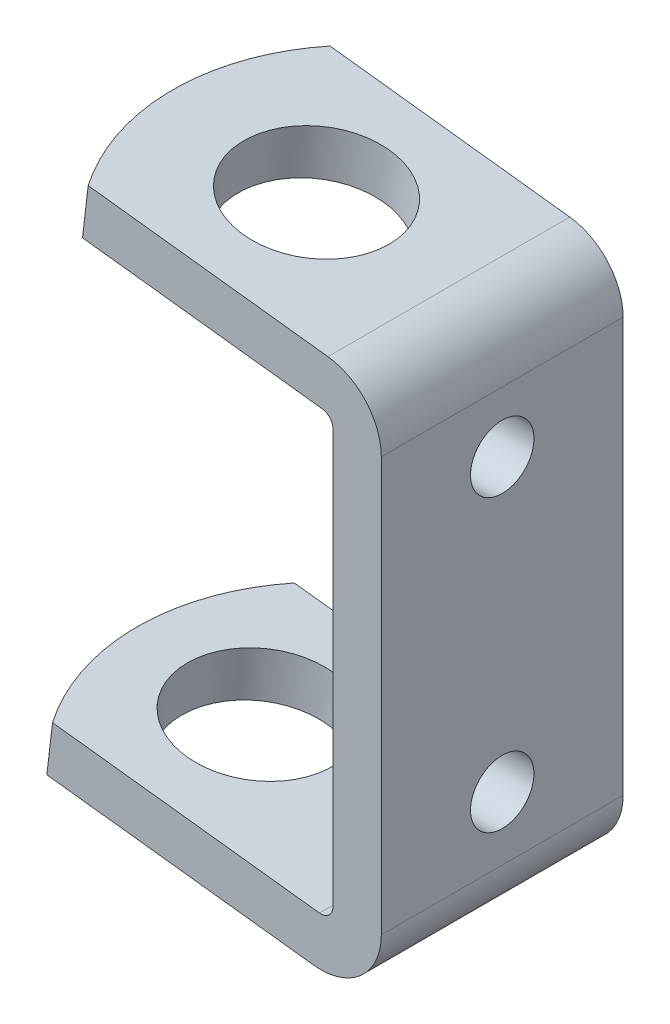
ISO-10303-21;
HEADER;
FILE_DESCRIPTION(('STEP AP214'),'2;1');
FILE_NAME('part.step','',(''),(''),'','','');
FILE_SCHEMA(('AUTOMOTIVE_DESIGN { 1 0 10303 214 1 1 1 1 }'));
ENDSEC;
DATA;
#1=APPLICATION_CONTEXT('core data for automotive mechanical design processes');
#2=APPLICATION_PROTOCOL_DEFINITION('international standard','automotive_design',2000,#1);
#3=PRODUCT_CONTEXT('',#1,'mechanical');
#4=PRODUCT('Part','Part','',(#3));
#5=PRODUCT_RELATED_PRODUCT_CATEGORY('part','',(#4));
#6=PRODUCT_DEFINITION_FORMATION('','',#4);
#7=PRODUCT_DEFINITION_CONTEXT('part definition',#1,'design');
#8=PRODUCT_DEFINITION('design','',#6,#7);
#9=PRODUCT_DEFINITION_SHAPE('','',#8);
#10=(LENGTH_UNIT() NAMED_UNIT(*) SI_UNIT(.MILLI.,.METRE.));
#11=(NAMED_UNIT(*) PLANE_ANGLE_UNIT() SI_UNIT($,.RADIAN.));
#12=(NAMED_UNIT(*) SI_UNIT($,.STERADIAN.) SOLID_ANGLE_UNIT());
#13=UNCERTAINTY_MEASURE_WITH_UNIT(LENGTH_MEASURE(1.E-05),#10,'distance_accuracy_value','');
#14=(GEOMETRIC_REPRESENTATION_CONTEXT(3) GLOBAL_UNCERTAINTY_ASSIGNED_CONTEXT((#13)) GLOBAL_UNIT_ASSIGNED_CONTEXT((#10,
#11,#12)) REPRESENTATION_CONTEXT('',''));
#15=CARTESIAN_POINT('',(0.,0.,0.));
#16=DIRECTION('',(0.,0.,1.));
#17=DIRECTION('',(1.,0.,0.));
#18=AXIS2_PLACEMENT_3D('',#15,#16,#17);
#19=CARTESIAN_POINT('',(16.1601957420386,2.8418070474657,0.));
#20=DIRECTION('',(0.1169596337903,0.993136669378208,0.));
#21=DIRECTION('',(-0.993136669378208,0.1169596337903,0.));
#22=AXIS2_PLACEMENT_3D('',#19,#20,#21);
#23=CYLINDRICAL_SURFACE('',#22,9.6012);
#24=CARTESIAN_POINT('',(16.1601957420386,2.84180704746571,0.));
#25=DIRECTION('',(0.1169596337903,0.993136669378208,0.));
#26=DIRECTION('',(-0.993136669378208,0.1169596337903,0.));
#27=AXIS2_PLACEMENT_3D('',#24,#25,#26);
#28=CIRCLE('',#27,9.6012);
#29=CARTESIAN_POINT('',(6.62489195200452,3.96475988341313,0.));
#30=VERTEX_POINT('',#29);
#31=EDGE_CURVE('E20',#30,#30,#28,.T.);
#32=ORIENTED_EDGE('',*,*,#31,.F.);
#33=EDGE_LOOP('',(#32));
#34=FACE_BOUND('',#33,.T.);
#35=CARTESIAN_POINT('',(16.902889416607,9.14822489801733,0.));
#36=DIRECTION('',(0.1169596337903,0.993136669378208,0.));
#37=DIRECTION('',(-0.993136669378208,0.1169596337903,0.));
#38=AXIS2_PLACEMENT_3D('',#35,#36,#37);
#39=CIRCLE('',#38,9.6012);
#40=CARTESIAN_POINT('',(7.36758562657293,10.2711777339648,0.));
#41=VERTEX_POINT('',#40);
#42=EDGE_CURVE('E183',#41,#41,#39,.F.);
#43=ORIENTED_EDGE('',*,*,#42,.F.);
#44=EDGE_LOOP('',(#43));
#45=FACE_BOUND('',#44,.T.);
#46=ADVANCED_FACE('F17',(#34,#45),#23,.F.);
#47=CARTESIAN_POINT('',(24.3075817343848,72.2230147334628,0.));
#48=DIRECTION('',(-0.116959633790301,-0.993136669378207,0.));
#49=DIRECTION('',(0.993136669378207,-0.116959633790301,0.));
#50=AXIS2_PLACEMENT_3D('',#47,#48,#49);
#51=CYLINDRICAL_SURFACE('',#50,9.6012);
#52=CARTESIAN_POINT('',(24.3075817343848,72.2230147334628,0.));
#53=DIRECTION('',(-0.116959633790301,-0.993136669378207,0.));
#54=DIRECTION('',(0.993136669378207,-0.116959633790301,0.));
#55=AXIS2_PLACEMENT_3D('',#52,#53,#54);
#56=CIRCLE('',#55,9.6012);
#57=CARTESIAN_POINT('',(33.8428855244188,71.1000618975154,0.));
#58=VERTEX_POINT('',#57);
#59=EDGE_CURVE('E172',#58,#58,#56,.T.);
#60=ORIENTED_EDGE('',*,*,#59,.F.);
#61=EDGE_LOOP('',(#60));
#62=FACE_BOUND('',#61,.T.);
#63=CARTESIAN_POINT('',(23.5648880598164,65.9165968829112,0.));
#64=DIRECTION('',(-0.116959633790301,-0.993136669378207,0.));
#65=DIRECTION('',(0.993136669378207,-0.116959633790301,0.));
#66=AXIS2_PLACEMENT_3D('',#63,#64,#65);
#67=CIRCLE('',#66,9.6012);
#68=CARTESIAN_POINT('',(33.1001918498504,64.7936440469638,0.));
#69=VERTEX_POINT('',#68);
#70=EDGE_CURVE('E114',#69,#69,#67,.F.);
#71=ORIENTED_EDGE('',*,*,#70,.F.);
#72=EDGE_LOOP('',(#71));
#73=FACE_BOUND('',#72,.T.);
#74=ADVANCED_FACE('F397',(#62,#73),#51,.F.);
#75=CARTESIAN_POINT('',(39.8281819351588,0.054477686810474,0.));
#76=DIRECTION('',(-0.1169596337903,-0.993136669378207,0.));
#77=DIRECTION('',(0.993136669378207,-0.1169596337903,0.));
#78=AXIS2_PLACEMENT_3D('',#75,#76,#77);
#79=PLANE('',#78);
#80=ORIENTED_EDGE('',*,*,#31,.T.);
#81=EDGE_LOOP('',(#80));
#82=FACE_BOUND('',#81,.T.);
#83=DIRECTION('',(0.,0.,1.));
#84=VECTOR('',#83,1.);
#85=CARTESIAN_POINT('',(39.8281819351588,0.0544776868104824,0.));
#86=LINE('',#85,#84);
#87=CARTESIAN_POINT('',(39.8281819351588,0.0544776868104755,15.875));
#88=VERTEX_POINT('',#87);
#89=CARTESIAN_POINT('',(39.8281819351588,0.0544776868104755,-15.875));
#90=VERTEX_POINT('',#89);
#91=EDGE_CURVE('E166',#88,#90,#86,.F.);
#92=ORIENTED_EDGE('',*,*,#91,.F.);
#93=DIRECTION('',(0.993136669378208,-0.1169596337903,0.));
#94=VECTOR('',#93,1.);
#95=CARTESIAN_POINT('',(4.78242539288279,4.18174332654856,15.875));
#96=LINE('',#95,#94);
#97=CARTESIAN_POINT('',(4.78242539288279,4.18174332654856,15.875));
#98=VERTEX_POINT('',#97);
#99=EDGE_CURVE('E130',#98,#88,#96,.T.);
#100=ORIENTED_EDGE('',*,*,#99,.F.);
#101=CARTESIAN_POINT('',(28.3788803274823,1.40283805298941,0.));
#102=DIRECTION('',(0.1169596337903,0.993136669378208,0.));
#103=DIRECTION('',(-0.993136669378208,0.1169596337903,0.));
#104=AXIS2_PLACEMENT_3D('',#101,#102,#103);
#105=CIRCLE('',#104,28.575);
#106=CARTESIAN_POINT('',(4.78242539288277,4.18174332654856,-15.875));
#107=VERTEX_POINT('',#106);
#108=EDGE_CURVE('E178',#107,#98,#105,.T.);
#109=ORIENTED_EDGE('',*,*,#108,.F.);
#110=DIRECTION('',(0.993136669378208,-0.1169596337903,0.));
#111=VECTOR('',#110,1.);
#112=CARTESIAN_POINT('',(4.78242539288276,4.18174332654856,-15.875));
#113=LINE('',#112,#111);
#114=EDGE_CURVE('E162',#107,#90,#113,.T.);
#115=ORIENTED_EDGE('',*,*,#114,.T.);
#116=EDGE_LOOP('',(#92,#100,#109,#115));
#117=FACE_BOUND('',#116,.T.);
#118=ADVANCED_FACE('F238',(#82,#117),#79,.T.);
#119=CARTESIAN_POINT('',(33.8018938083902,71.1048894064,0.));
#120=DIRECTION('',(-0.116959633790301,-0.993136669378207,0.));
#121=DIRECTION('',(0.993136669378207,-0.116959633790301,0.));
#122=AXIS2_PLACEMENT_3D('',#119,#120,#121);
#123=CYLINDRICAL_SURFACE('',#122,28.575);
#124=CARTESIAN_POINT('',(33.8018938083902,71.1048894064001,0.));
#125=DIRECTION('',(-0.116959633790301,-0.993136669378207,0.));
#126=DIRECTION('',(0.993136669378207,-0.116959633790301,0.));
#127=AXIS2_PLACEMENT_3D('',#124,#125,#126);
#128=CIRCLE('',#127,28.575);
#129=CARTESIAN_POINT('',(10.2054388737907,73.8837946799592,-15.875));
#130=VERTEX_POINT('',#129);
#131=CARTESIAN_POINT('',(10.2054388737907,73.8837946799592,15.875));
#132=VERTEX_POINT('',#131);
#133=EDGE_CURVE('E176',#130,#132,#128,.F.);
#134=ORIENTED_EDGE('',*,*,#133,.F.);
#135=DIRECTION('',(-0.1169596337903,-0.993136669378207,0.));
#136=VECTOR('',#135,1.);
#137=CARTESIAN_POINT('',(10.2054388737907,73.8837946799592,-15.875));
#138=LINE('',#137,#136);
#139=CARTESIAN_POINT('',(9.46274519922232,67.5773768294076,-15.875));
#140=VERTEX_POINT('',#139);
#141=EDGE_CURVE('E111',#130,#140,#138,.T.);
#142=ORIENTED_EDGE('',*,*,#141,.T.);
#143=CARTESIAN_POINT('',(33.0592001338218,64.7984715558484,0.));
#144=DIRECTION('',(-0.116959633790301,-0.993136669378207,0.));
#145=DIRECTION('',(0.993136669378207,-0.116959633790301,0.));
#146=AXIS2_PLACEMENT_3D('',#143,#144,#145);
#147=CIRCLE('',#146,28.575);
#148=CARTESIAN_POINT('',(9.46274519922232,67.5773768294076,15.875));
#149=VERTEX_POINT('',#148);
#150=EDGE_CURVE('E104',#149,#140,#147,.T.);
#151=ORIENTED_EDGE('',*,*,#150,.F.);
#152=DIRECTION('',(-0.1169596337903,-0.993136669378207,0.));
#153=VECTOR('',#152,1.);
#154=CARTESIAN_POINT('',(10.2054388737907,73.8837946799592,15.875));
#155=LINE('',#154,#153);
#156=EDGE_CURVE('E108',#132,#149,#155,.T.);
#157=ORIENTED_EDGE('',*,*,#156,.F.);
#158=EDGE_LOOP('',(#134,#142,#151,#157));
#159=FACE_BOUND('',#158,.T.);
#160=ADVANCED_FACE('F106',(#159),#123,.T.);
#161=CARTESIAN_POINT('',(40.9422224470114,63.8701044626379,0.));
#162=DIRECTION('',(-0.1169596337903,-0.993136669378207,0.));
#163=DIRECTION('',(0.993136669378207,-0.1169596337903,0.));
#164=AXIS2_PLACEMENT_3D('',#161,#162,#163);
#165=PLANE('',#164);
#166=ORIENTED_EDGE('',*,*,#70,.T.);
#167=EDGE_LOOP('',(#166));
#168=FACE_BOUND('',#167,.T.);
#169=DIRECTION('',(0.,0.,1.));
#170=VECTOR('',#169,1.);
#171=CARTESIAN_POINT('',(40.9422224470114,63.8701044626379,0.));
#172=LINE('',#171,#170);
#173=CARTESIAN_POINT('',(40.9422224470114,63.8701044626379,-15.875));
#174=VERTEX_POINT('',#173);
#175=CARTESIAN_POINT('',(40.9422224470114,63.8701044626379,15.875));
#176=VERTEX_POINT('',#175);
#177=EDGE_CURVE('E119',#174,#176,#172,.T.);
#178=ORIENTED_EDGE('',*,*,#177,.T.);
#179=DIRECTION('',(0.993136669378207,-0.1169596337903,0.));
#180=VECTOR('',#179,1.);
#181=CARTESIAN_POINT('',(9.46274519922232,67.5773768294076,15.875));
#182=LINE('',#181,#180);
#183=EDGE_CURVE('E116',#149,#176,#182,.T.);
#184=ORIENTED_EDGE('',*,*,#183,.F.);
#185=ORIENTED_EDGE('',*,*,#150,.T.);
#186=DIRECTION('',(0.993136669378207,-0.1169596337903,0.));
#187=VECTOR('',#186,1.);
#188=CARTESIAN_POINT('',(9.46274519922232,67.5773768294076,-15.875));
#189=LINE('',#188,#187);
#190=EDGE_CURVE('E158',#140,#174,#189,.T.);
#191=ORIENTED_EDGE('',*,*,#190,.T.);
#192=EDGE_LOOP('',(#178,#184,#185,#191));
#193=FACE_BOUND('',#192,.T.);
#194=ADVANCED_FACE('F117',(#168,#193),#165,.T.);
#195=CARTESIAN_POINT('',(40.7565490283693,62.2935,0.));
#196=DIRECTION('',(0.,0.,1.));
#197=DIRECTION('',(1.,0.,0.));
#198=AXIS2_PLACEMENT_3D('',#195,#196,#197);
#199=CYLINDRICAL_SURFACE('',#198,1.5875);
#200=ORIENTED_EDGE('',*,*,#177,.F.);
#201=CARTESIAN_POINT('',(40.7565490283693,62.2935,-15.875));
#202=DIRECTION('',(0.,0.,1.));
#203=DIRECTION('',(1.,0.,0.));
#204=AXIS2_PLACEMENT_3D('',#201,#202,#203);
#205=CIRCLE('',#204,1.5875);
#206=CARTESIAN_POINT('',(42.3440490283693,62.2935,-15.875));
#207=VERTEX_POINT('',#206);
#208=EDGE_CURVE('E156',#174,#207,#205,.F.);
#209=ORIENTED_EDGE('',*,*,#208,.T.);
#210=DIRECTION('',(0.,0.,1.));
#211=VECTOR('',#210,1.);
#212=CARTESIAN_POINT('',(42.3440490283693,62.2935,0.));
#213=LINE('',#212,#211);
#214=CARTESIAN_POINT('',(42.3440490283693,62.2935,15.875));
#215=VERTEX_POINT('',#214);
#216=EDGE_CURVE('E175',#215,#207,#213,.F.);
#217=ORIENTED_EDGE('',*,*,#216,.F.);
#218=CARTESIAN_POINT('',(40.7565490283693,62.2935,15.875));
#219=DIRECTION('',(0.,0.,1.));
#220=DIRECTION('',(1.,0.,0.));
#221=AXIS2_PLACEMENT_3D('',#218,#219,#220);
#222=CIRCLE('',#221,1.5875);
#223=EDGE_CURVE('E123',#176,#215,#222,.F.);
#224=ORIENTED_EDGE('',*,*,#223,.F.);
#225=EDGE_LOOP('',(#200,#209,#217,#224));
#226=FACE_BOUND('',#225,.T.);
#227=ADVANCED_FACE('F254',(#226),#199,.F.);
#228=CARTESIAN_POINT('',(40.7565490283693,7.93750000000003,0.));
#229=DIRECTION('',(0.,0.,1.));
#230=DIRECTION('',(1.,0.,0.));
#231=AXIS2_PLACEMENT_3D('',#228,#229,#230);
#232=CYLINDRICAL_SURFACE('',#231,1.5875);
#233=DIRECTION('',(0.,0.,1.));
#234=VECTOR('',#233,1.);
#235=CARTESIAN_POINT('',(42.3440490283693,7.93750000000003,0.));
#236=LINE('',#235,#234);
#237=CARTESIAN_POINT('',(42.3440490283693,7.93750000000003,-15.875));
#238=VERTEX_POINT('',#237);
#239=CARTESIAN_POINT('',(42.3440490283693,7.93750000000003,15.875));
#240=VERTEX_POINT('',#239);
#241=EDGE_CURVE('E195',#238,#240,#236,.T.);
#242=ORIENTED_EDGE('',*,*,#241,.F.);
#243=CARTESIAN_POINT('',(40.7565490283693,7.93750000000003,-15.875));
#244=DIRECTION('',(0.,0.,1.));
#245=DIRECTION('',(1.,0.,0.));
#246=AXIS2_PLACEMENT_3D('',#243,#244,#245);
#247=CIRCLE('',#246,1.5875);
#248=CARTESIAN_POINT('',(40.5708756097272,6.36089553736211,-15.875));
#249=VERTEX_POINT('',#248);
#250=EDGE_CURVE('E152',#238,#249,#247,.F.);
#251=ORIENTED_EDGE('',*,*,#250,.T.);
#252=DIRECTION('',(0.,0.,1.));
#253=VECTOR('',#252,1.);
#254=CARTESIAN_POINT('',(40.5708756097272,6.3608955373621,0.));
#255=LINE('',#254,#253);
#256=CARTESIAN_POINT('',(40.5708756097272,6.36089553736211,15.875));
#257=VERTEX_POINT('',#256);
#258=EDGE_CURVE('E186',#257,#249,#255,.F.);
#259=ORIENTED_EDGE('',*,*,#258,.F.);
#260=CARTESIAN_POINT('',(40.7565490283693,7.93750000000003,15.875));
#261=DIRECTION('',(0.,0.,1.));
#262=DIRECTION('',(1.,0.,0.));
#263=AXIS2_PLACEMENT_3D('',#260,#261,#262);
#264=CIRCLE('',#263,1.5875);
#265=EDGE_CURVE('E168',#240,#257,#264,.F.);
#266=ORIENTED_EDGE('',*,*,#265,.F.);
#267=EDGE_LOOP('',(#242,#251,#259,#266));
#268=FACE_BOUND('',#267,.T.);
#269=ADVANCED_FACE('F359',(#268),#232,.F.);
#270=CARTESIAN_POINT('',(0.74269367456843,11.0513774390989,0.));
#271=DIRECTION('',(0.1169596337903,0.993136669378207,0.));
#272=DIRECTION('',(-0.993136669378207,0.1169596337903,0.));
#273=AXIS2_PLACEMENT_3D('',#270,#271,#272);
#274=PLANE('',#273);
#275=ORIENTED_EDGE('',*,*,#42,.T.);
#276=EDGE_LOOP('',(#275));
#277=FACE_BOUND('',#276,.T.);
#278=ORIENTED_EDGE('',*,*,#258,.T.);
#279=DIRECTION('',(-0.993136669378208,0.1169596337903,0.));
#280=VECTOR('',#279,1.);
#281=CARTESIAN_POINT('',(40.5708756097272,6.36089553736212,-15.875));
#282=LINE('',#281,#280);
#283=CARTESIAN_POINT('',(5.52511906745118,10.4881611771002,-15.875));
#284=VERTEX_POINT('',#283);
#285=EDGE_CURVE('E154',#249,#284,#282,.T.);
#286=ORIENTED_EDGE('',*,*,#285,.T.);
#287=CARTESIAN_POINT('',(29.1215740020507,7.70925590354103,0.));
#288=DIRECTION('',(0.1169596337903,0.993136669378208,0.));
#289=DIRECTION('',(-0.993136669378208,0.1169596337903,0.));
#290=AXIS2_PLACEMENT_3D('',#287,#288,#289);
#291=CIRCLE('',#290,28.575);
#292=CARTESIAN_POINT('',(5.5251190674512,10.4881611771002,15.875));
#293=VERTEX_POINT('',#292);
#294=EDGE_CURVE('E180',#293,#284,#291,.F.);
#295=ORIENTED_EDGE('',*,*,#294,.F.);
#296=DIRECTION('',(-0.993136669378208,0.116959633790299,0.));
#297=VECTOR('',#296,1.);
#298=CARTESIAN_POINT('',(40.5708756097272,6.36089553736212,15.875));
#299=LINE('',#298,#297);
#300=EDGE_CURVE('E167',#257,#293,#299,.T.);
#301=ORIENTED_EDGE('',*,*,#300,.F.);
#302=EDGE_LOOP('',(#278,#286,#295,#301));
#303=FACE_BOUND('',#302,.T.);
#304=ADVANCED_FACE('F351',(#277,#303),#274,.T.);
#305=CARTESIAN_POINT('',(28.3788803274823,1.40283805298943,0.));
#306=DIRECTION('',(0.1169596337903,0.993136669378208,0.));
#307=DIRECTION('',(-0.993136669378208,0.1169596337903,0.));
#308=AXIS2_PLACEMENT_3D('',#305,#306,#307);
#309=CYLINDRICAL_SURFACE('',#308,28.575);
#310=ORIENTED_EDGE('',*,*,#108,.T.);
#311=DIRECTION('',(-0.1169596337903,-0.993136669378207,0.));
#312=VECTOR('',#311,1.);
#313=CARTESIAN_POINT('',(5.5251190674512,10.4881611771002,15.875));
#314=LINE('',#313,#312);
#315=EDGE_CURVE('E133',#293,#98,#314,.T.);
#316=ORIENTED_EDGE('',*,*,#315,.F.);
#317=ORIENTED_EDGE('',*,*,#294,.T.);
#318=DIRECTION('',(-0.1169596337903,-0.993136669378208,0.));
#319=VECTOR('',#318,1.);
#320=CARTESIAN_POINT('',(5.52511906745117,10.4881611771002,-15.875));
#321=LINE('',#320,#319);
#322=EDGE_CURVE('E151',#284,#107,#321,.T.);
#323=ORIENTED_EDGE('',*,*,#322,.T.);
#324=EDGE_LOOP('',(#310,#316,#317,#323));
#325=FACE_BOUND('',#324,.T.);
#326=ADVANCED_FACE('F236',(#325),#309,.T.);
#327=CARTESIAN_POINT('',(5.42301348090794,74.4470109419579,0.));
#328=DIRECTION('',(0.116959633790301,0.993136669378207,0.));
#329=DIRECTION('',(-0.993136669378207,0.116959633790301,0.));
#330=AXIS2_PLACEMENT_3D('',#327,#328,#329);
#331=PLANE('',#330);
#332=ORIENTED_EDGE('',*,*,#59,.T.);
#333=EDGE_LOOP('',(#332));
#334=FACE_BOUND('',#333,.T.);
#335=DIRECTION('',(0.,0.,1.));
#336=VECTOR('',#335,1.);
#337=CARTESIAN_POINT('',(41.6849161215798,70.1765223131895,0.));
#338=LINE('',#337,#336);
#339=CARTESIAN_POINT('',(41.6849161215798,70.1765223131895,-15.875));
#340=VERTEX_POINT('',#339);
#341=CARTESIAN_POINT('',(41.6849161215798,70.1765223131895,15.875));
#342=VERTEX_POINT('',#341);
#343=EDGE_CURVE('E146',#340,#342,#338,.T.);
#344=ORIENTED_EDGE('',*,*,#343,.F.);
#345=DIRECTION('',(-0.993136669378207,0.116959633790301,0.));
#346=VECTOR('',#345,1.);
#347=CARTESIAN_POINT('',(41.6849161215798,70.1765223131895,-15.875));
#348=LINE('',#347,#346);
#349=EDGE_CURVE('E161',#340,#130,#348,.T.);
#350=ORIENTED_EDGE('',*,*,#349,.T.);
#351=ORIENTED_EDGE('',*,*,#133,.T.);
#352=DIRECTION('',(-0.993136669378207,0.116959633790301,0.));
#353=VECTOR('',#352,1.);
#354=CARTESIAN_POINT('',(41.6849161215798,70.1765223131895,15.875));
#355=LINE('',#354,#353);
#356=EDGE_CURVE('E128',#342,#132,#355,.T.);
#357=ORIENTED_EDGE('',*,*,#356,.F.);
#358=EDGE_LOOP('',(#344,#350,#351,#357));
#359=FACE_BOUND('',#358,.T.);
#360=ADVANCED_FACE('F257',(#334,#359),#331,.T.);
#361=CARTESIAN_POINT('',(42.3440490283693,7.93750000000003,0.));
#362=DIRECTION('',(-1.,0.,0.));
#363=DIRECTION('',(0.,0.,1.));
#364=AXIS2_PLACEMENT_3D('',#361,#362,#363);
#365=PLANE('',#364);
#366=CARTESIAN_POINT('',(42.3440490283693,16.2560000000001,0.));
#367=DIRECTION('',(-1.,0.,0.));
#368=DIRECTION('',(0.,-1.,0.));
#369=AXIS2_PLACEMENT_3D('',#366,#367,#368);
#370=CIRCLE('',#369,4.1671875);
#371=CARTESIAN_POINT('',(42.3440490283693,12.0888125000001,0.));
#372=VERTEX_POINT('',#371);
#373=EDGE_CURVE('E139',#372,#372,#370,.F.);
#374=ORIENTED_EDGE('',*,*,#373,.T.);
#375=EDGE_LOOP('',(#374));
#376=FACE_BOUND('',#375,.T.);
#377=CARTESIAN_POINT('',(42.3440490283693,54.356,0.));
#378=DIRECTION('',(-1.,0.,0.));
#379=DIRECTION('',(0.,-1.,0.));
#380=AXIS2_PLACEMENT_3D('',#377,#378,#379);
#381=CIRCLE('',#380,4.1671875);
#382=CARTESIAN_POINT('',(42.3440490283693,50.1888125,0.));
#383=VERTEX_POINT('',#382);
#384=EDGE_CURVE('E143',#383,#383,#381,.F.);
#385=ORIENTED_EDGE('',*,*,#384,.T.);
#386=EDGE_LOOP('',(#385));
#387=FACE_BOUND('',#386,.T.);
#388=DIRECTION('',(0.,1.,0.));
#389=VECTOR('',#388,1.);
#390=CARTESIAN_POINT('',(42.3440490283693,35.4324080580941,-15.875));
#391=LINE('',#390,#389);
#392=EDGE_CURVE('E155',#207,#238,#391,.F.);
#393=ORIENTED_EDGE('',*,*,#392,.T.);
#394=ORIENTED_EDGE('',*,*,#241,.T.);
#395=DIRECTION('',(0.,1.,0.));
#396=VECTOR('',#395,1.);
#397=CARTESIAN_POINT('',(42.3440490283693,35.4324080580942,15.875));
#398=LINE('',#397,#396);
#399=EDGE_CURVE('E170',#215,#240,#398,.F.);
#400=ORIENTED_EDGE('',*,*,#399,.F.);
#401=ORIENTED_EDGE('',*,*,#216,.T.);
#402=EDGE_LOOP('',(#393,#394,#400,#401));
#403=FACE_BOUND('',#402,.T.);
#404=ADVANCED_FACE('F255',(#376,#387,#403),#365,.T.);
#405=CARTESIAN_POINT('',(31.6835415138049,35.4324080580942,15.875));
#406=DIRECTION('',(0.,0.,1.));
#407=DIRECTION('',(1.,0.,0.));
#408=AXIS2_PLACEMENT_3D('',#405,#406,#407);
#409=PLANE('',#408);
#410=ORIENTED_EDGE('',*,*,#265,.T.);
#411=ORIENTED_EDGE('',*,*,#300,.T.);
#412=ORIENTED_EDGE('',*,*,#315,.T.);
#413=ORIENTED_EDGE('',*,*,#99,.T.);
#414=CARTESIAN_POINT('',(40.7565490283693,7.9375,15.875));
#415=DIRECTION('',(0.,0.,1.));
#416=DIRECTION('',(1.,0.,0.));
#417=AXIS2_PLACEMENT_3D('',#414,#415,#416);
#418=CIRCLE('',#417,7.9375);
#419=CARTESIAN_POINT('',(48.6940490283693,7.93750000000001,15.875));
#420=VERTEX_POINT('',#419);
#421=EDGE_CURVE('E163',#420,#88,#418,.F.);
#422=ORIENTED_EDGE('',*,*,#421,.F.);
#423=DIRECTION('',(0.,1.,0.));
#424=VECTOR('',#423,1.);
#425=CARTESIAN_POINT('',(48.6940490283693,62.2935,15.875));
#426=LINE('',#425,#424);
#427=CARTESIAN_POINT('',(48.6940490283693,62.2935,15.875));
#428=VERTEX_POINT('',#427);
#429=EDGE_CURVE('E142',#428,#420,#426,.F.);
#430=ORIENTED_EDGE('',*,*,#429,.F.);
#431=CARTESIAN_POINT('',(40.7565490283693,62.2935,15.875));
#432=DIRECTION('',(0.,0.,1.));
#433=DIRECTION('',(1.,0.,0.));
#434=AXIS2_PLACEMENT_3D('',#431,#432,#433);
#435=CIRCLE('',#434,7.9375);
#436=EDGE_CURVE('E148',#342,#428,#435,.F.);
#437=ORIENTED_EDGE('',*,*,#436,.F.);
#438=ORIENTED_EDGE('',*,*,#356,.T.);
#439=ORIENTED_EDGE('',*,*,#156,.T.);
#440=ORIENTED_EDGE('',*,*,#183,.T.);
#441=ORIENTED_EDGE('',*,*,#223,.T.);
#442=ORIENTED_EDGE('',*,*,#399,.T.);
#443=EDGE_LOOP('',(#410,#411,#412,#413,#422,#430,#437,#438,#439,#440,#441,#442));
#444=FACE_BOUND('',#443,.T.);
#445=ADVANCED_FACE('F126',(#444),#409,.T.);
#446=CARTESIAN_POINT('',(40.7565490283693,7.9375,0.));
#447=DIRECTION('',(0.,0.,1.));
#448=DIRECTION('',(1.,0.,0.));
#449=AXIS2_PLACEMENT_3D('',#446,#447,#448);
#450=CYLINDRICAL_SURFACE('',#449,7.9375);
#451=CARTESIAN_POINT('',(40.7565490283693,7.9375,-15.875));
#452=DIRECTION('',(0.,0.,1.));
#453=DIRECTION('',(1.,0.,0.));
#454=AXIS2_PLACEMENT_3D('',#451,#452,#453);
#455=CIRCLE('',#454,7.9375);
#456=CARTESIAN_POINT('',(48.6940490283693,7.93750000000001,-15.875));
#457=VERTEX_POINT('',#456);
#458=EDGE_CURVE('E159',#90,#457,#455,.T.);
#459=ORIENTED_EDGE('',*,*,#458,.T.);
#460=DIRECTION('',(0.,0.,-1.));
#461=VECTOR('',#460,1.);
#462=CARTESIAN_POINT('',(48.6940490283693,7.93750000000003,0.));
#463=LINE('',#462,#461);
#464=EDGE_CURVE('E207',#420,#457,#463,.T.);
#465=ORIENTED_EDGE('',*,*,#464,.F.);
#466=ORIENTED_EDGE('',*,*,#421,.T.);
#467=ORIENTED_EDGE('',*,*,#91,.T.);
#468=EDGE_LOOP('',(#459,#465,#466,#467));
#469=FACE_BOUND('',#468,.T.);
#470=ADVANCED_FACE('F240',(#469),#450,.T.);
#471=CARTESIAN_POINT('',(31.6835415138049,35.4324080580941,-15.875));
#472=DIRECTION('',(0.,0.,1.));
#473=DIRECTION('',(1.,0.,0.));
#474=AXIS2_PLACEMENT_3D('',#471,#472,#473);
#475=PLANE('',#474);
#476=ORIENTED_EDGE('',*,*,#285,.F.);
#477=ORIENTED_EDGE('',*,*,#250,.F.);
#478=ORIENTED_EDGE('',*,*,#392,.F.);
#479=ORIENTED_EDGE('',*,*,#208,.F.);
#480=ORIENTED_EDGE('',*,*,#190,.F.);
#481=ORIENTED_EDGE('',*,*,#141,.F.);
#482=ORIENTED_EDGE('',*,*,#349,.F.);
#483=CARTESIAN_POINT('',(40.7565490283693,62.2935,-15.875));
#484=DIRECTION('',(0.,0.,1.));
#485=DIRECTION('',(1.,0.,0.));
#486=AXIS2_PLACEMENT_3D('',#483,#484,#485);
#487=CIRCLE('',#486,7.9375);
#488=CARTESIAN_POINT('',(48.6940490283693,62.2935,-15.875));
#489=VERTEX_POINT('',#488);
#490=EDGE_CURVE('E35',#489,#340,#487,.T.);
#491=ORIENTED_EDGE('',*,*,#490,.F.);
#492=DIRECTION('',(0.,1.,0.));
#493=VECTOR('',#492,1.);
#494=CARTESIAN_POINT('',(48.6940490283693,62.2935,-15.875));
#495=LINE('',#494,#493);
#496=EDGE_CURVE('E210',#457,#489,#495,.T.);
#497=ORIENTED_EDGE('',*,*,#496,.F.);
#498=ORIENTED_EDGE('',*,*,#458,.F.);
#499=ORIENTED_EDGE('',*,*,#114,.F.);
#500=ORIENTED_EDGE('',*,*,#322,.F.);
#501=EDGE_LOOP('',(#476,#477,#478,#479,#480,#481,#482,#491,#497,#498,#499,#500));
#502=FACE_BOUND('',#501,.T.);
#503=ADVANCED_FACE('F247',(#502),#475,.F.);
#504=CARTESIAN_POINT('',(40.7565490283693,62.2935,0.));
#505=DIRECTION('',(0.,0.,1.));
#506=DIRECTION('',(1.,0.,0.));
#507=AXIS2_PLACEMENT_3D('',#504,#505,#506);
#508=CYLINDRICAL_SURFACE('',#507,7.9375);
#509=ORIENTED_EDGE('',*,*,#490,.T.);
#510=ORIENTED_EDGE('',*,*,#343,.T.);
#511=ORIENTED_EDGE('',*,*,#436,.T.);
#512=DIRECTION('',(0.,0.,-1.));
#513=VECTOR('',#512,1.);
#514=CARTESIAN_POINT('',(48.6940490283693,62.2935,0.));
#515=LINE('',#514,#513);
#516=EDGE_CURVE('E138',#489,#428,#515,.F.);
#517=ORIENTED_EDGE('',*,*,#516,.F.);
#518=EDGE_LOOP('',(#509,#510,#511,#517));
#519=FACE_BOUND('',#518,.T.);
#520=ADVANCED_FACE('F243',(#519),#508,.T.);
#521=CARTESIAN_POINT('',(48.6940490283693,54.356,0.));
#522=DIRECTION('',(-1.,0.,0.));
#523=DIRECTION('',(0.,-1.,0.));
#524=AXIS2_PLACEMENT_3D('',#521,#522,#523);
#525=CYLINDRICAL_SURFACE('',#524,4.1671875);
#526=CARTESIAN_POINT('',(48.6940490283693,54.356,0.));
#527=DIRECTION('',(-1.,0.,0.));
#528=DIRECTION('',(0.,-1.,0.));
#529=AXIS2_PLACEMENT_3D('',#526,#527,#528);
#530=CIRCLE('',#529,4.1671875);
#531=CARTESIAN_POINT('',(48.6940490283693,50.1888125,0.));
#532=VERTEX_POINT('',#531);
#533=EDGE_CURVE('E26',#532,#532,#530,.T.);
#534=ORIENTED_EDGE('',*,*,#533,.F.);
#535=EDGE_LOOP('',(#534));
#536=FACE_BOUND('',#535,.T.);
#537=ORIENTED_EDGE('',*,*,#384,.F.);
#538=EDGE_LOOP('',(#537));
#539=FACE_BOUND('',#538,.T.);
#540=ADVANCED_FACE('F276',(#536,#539),#525,.F.);
#541=CARTESIAN_POINT('',(48.6940490283693,16.2560000000001,0.));
#542=DIRECTION('',(-1.,0.,0.));
#543=DIRECTION('',(0.,-1.,0.));
#544=AXIS2_PLACEMENT_3D('',#541,#542,#543);
#545=CYLINDRICAL_SURFACE('',#544,4.1671875);
#546=CARTESIAN_POINT('',(48.6940490283693,16.2560000000001,0.));
#547=DIRECTION('',(-1.,0.,0.));
#548=DIRECTION('',(0.,-1.,0.));
#549=AXIS2_PLACEMENT_3D('',#546,#547,#548);
#550=CIRCLE('',#549,4.1671875);
#551=CARTESIAN_POINT('',(48.6940490283693,12.0888125000001,0.));
#552=VERTEX_POINT('',#551);
#553=EDGE_CURVE('E11',#552,#552,#550,.T.);
#554=ORIENTED_EDGE('',*,*,#553,.F.);
#555=EDGE_LOOP('',(#554));
#556=FACE_BOUND('',#555,.T.);
#557=ORIENTED_EDGE('',*,*,#373,.F.);
#558=EDGE_LOOP('',(#557));
#559=FACE_BOUND('',#558,.T.);
#560=ADVANCED_FACE('F270',(#556,#559),#545,.F.);
#561=CARTESIAN_POINT('',(48.6940490283693,62.2935,0.));
#562=DIRECTION('',(1.,0.,0.));
#563=DIRECTION('',(0.,0.,-1.));
#564=AXIS2_PLACEMENT_3D('',#561,#562,#563);
#565=PLANE('',#564);
#566=ORIENTED_EDGE('',*,*,#553,.T.);
#567=EDGE_LOOP('',(#566));
#568=FACE_BOUND('',#567,.T.);
#569=ORIENTED_EDGE('',*,*,#533,.T.);
#570=EDGE_LOOP('',(#569));
#571=FACE_BOUND('',#570,.T.);
#572=ORIENTED_EDGE('',*,*,#496,.T.);
#573=ORIENTED_EDGE('',*,*,#516,.T.);
#574=ORIENTED_EDGE('',*,*,#429,.T.);
#575=ORIENTED_EDGE('',*,*,#464,.T.);
#576=EDGE_LOOP('',(#572,#573,#574,#575));
#577=FACE_BOUND('',#576,.T.);
#578=ADVANCED_FACE('F245',(#568,#571,#577),#565,.T.);
#579=CLOSED_SHELL('',(#46,#74,#118,#160,#194,#227,#269,#304,#326,#360,#404,#445,#470,#503,#520,
#540,#560,#578));
#580=MANIFOLD_SOLID_BREP('B1',#579);
#581=ADVANCED_BREP_SHAPE_REPRESENTATION('',(#18,#580),#14);
#582=SHAPE_DEFINITION_REPRESENTATION(#9,#581);
ENDSEC;
END-ISO-10303-21;
